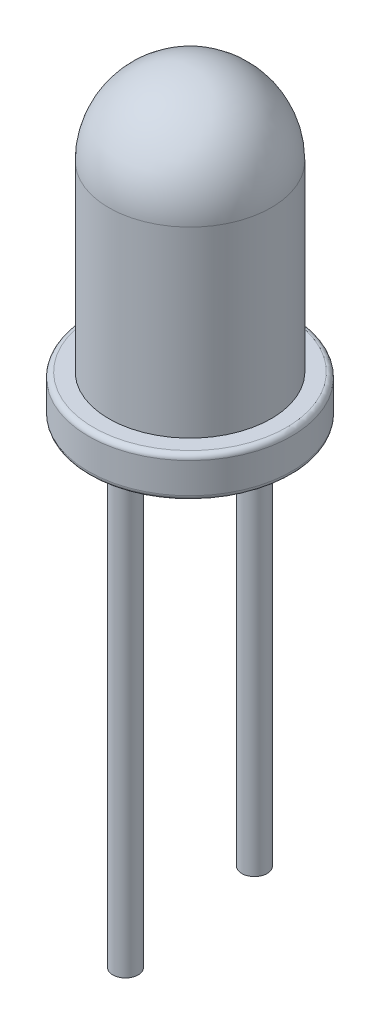
ISO-10303-21;
HEADER;
FILE_DESCRIPTION(('STEP AP214'),'2;1');
FILE_NAME('part.step','',(''),(''),'','','');
FILE_SCHEMA(('AUTOMOTIVE_DESIGN { 1 0 10303 214 1 1 1 1 }'));
ENDSEC;
DATA;
#1=APPLICATION_CONTEXT('core data for automotive mechanical design processes');
#2=APPLICATION_PROTOCOL_DEFINITION('international standard','automotive_design',2000,#1);
#3=PRODUCT_CONTEXT('',#1,'mechanical');
#4=PRODUCT('Part','Part','',(#3));
#5=PRODUCT_RELATED_PRODUCT_CATEGORY('part','',(#4));
#6=PRODUCT_DEFINITION_FORMATION('','',#4);
#7=PRODUCT_DEFINITION_CONTEXT('part definition',#1,'design');
#8=PRODUCT_DEFINITION('design','',#6,#7);
#9=PRODUCT_DEFINITION_SHAPE('','',#8);
#10=(LENGTH_UNIT() NAMED_UNIT(*) SI_UNIT(.MILLI.,.METRE.));
#11=(NAMED_UNIT(*) PLANE_ANGLE_UNIT() SI_UNIT($,.RADIAN.));
#12=(NAMED_UNIT(*) SI_UNIT($,.STERADIAN.) SOLID_ANGLE_UNIT());
#13=UNCERTAINTY_MEASURE_WITH_UNIT(LENGTH_MEASURE(1.E-05),#10,'distance_accuracy_value','');
#14=(GEOMETRIC_REPRESENTATION_CONTEXT(3) GLOBAL_UNCERTAINTY_ASSIGNED_CONTEXT((#13)) GLOBAL_UNIT_ASSIGNED_CONTEXT((#10,
#11,#12)) REPRESENTATION_CONTEXT('',''));
#15=CARTESIAN_POINT('',(0.,0.,0.));
#16=DIRECTION('',(0.,0.,1.));
#17=DIRECTION('',(1.,0.,0.));
#18=AXIS2_PLACEMENT_3D('',#15,#16,#17);
#19=CARTESIAN_POINT('',(0.,4.4,0.));
#20=DIRECTION('',(0.,1.,0.));
#21=DIRECTION('',(-1.,0.,0.));
#22=AXIS2_PLACEMENT_3D('',#19,#20,#21);
#23=SPHERICAL_SURFACE('',#22,1.6);
#24=CARTESIAN_POINT('',(0.,4.4,0.));
#25=DIRECTION('',(0.,1.,0.));
#26=DIRECTION('',(0.,0.,1.));
#27=AXIS2_PLACEMENT_3D('',#24,#25,#26);
#28=CIRCLE('',#27,1.6);
#29=CARTESIAN_POINT('',(0.,4.4,1.6));
#30=VERTEX_POINT('',#29);
#31=EDGE_CURVE('E59',#30,#30,#28,.T.);
#32=ORIENTED_EDGE('',*,*,#31,.T.);
#33=EDGE_LOOP('',(#32));
#34=FACE_BOUND('',#33,.T.);
#35=ADVANCED_FACE('F33',(#34),#23,.T.);
#36=CARTESIAN_POINT('',(0.,8.59832072129685,0.));
#37=DIRECTION('',(0.,1.,0.));
#38=DIRECTION('',(0.,0.,1.));
#39=AXIS2_PLACEMENT_3D('',#36,#37,#38);
#40=CYLINDRICAL_SURFACE('',#39,1.6);
#41=ORIENTED_EDGE('',*,*,#31,.F.);
#42=EDGE_LOOP('',(#41));
#43=FACE_BOUND('',#42,.T.);
#44=CARTESIAN_POINT('',(0.,0.799999999999999,0.));
#45=DIRECTION('',(0.,1.,0.));
#46=DIRECTION('',(0.,0.,1.));
#47=AXIS2_PLACEMENT_3D('',#44,#45,#46);
#48=CIRCLE('',#47,1.6);
#49=CARTESIAN_POINT('',(0.,0.799999999999999,1.6));
#50=VERTEX_POINT('',#49);
#51=EDGE_CURVE('E62',#50,#50,#48,.T.);
#52=ORIENTED_EDGE('',*,*,#51,.T.);
#53=EDGE_LOOP('',(#52));
#54=FACE_BOUND('',#53,.T.);
#55=ADVANCED_FACE('F87',(#43,#54),#40,.T.);
#56=CARTESIAN_POINT('',(0.,0.8,0.));
#57=DIRECTION('',(0.,-1.,0.));
#58=DIRECTION('',(0.,0.,-1.));
#59=AXIS2_PLACEMENT_3D('',#56,#57,#58);
#60=PLANE('',#59);
#61=CARTESIAN_POINT('',(0.,0.8,0.));
#62=DIRECTION('',(0.,-1.,0.));
#63=DIRECTION('',(0.,0.,-1.));
#64=AXIS2_PLACEMENT_3D('',#61,#62,#63);
#65=CIRCLE('',#64,1.9);
#66=CARTESIAN_POINT('',(0.,0.8,-1.9));
#67=VERTEX_POINT('',#66);
#68=EDGE_CURVE('E44',#67,#67,#65,.F.);
#69=ORIENTED_EDGE('',*,*,#68,.T.);
#70=EDGE_LOOP('',(#69));
#71=FACE_BOUND('',#70,.T.);
#72=ORIENTED_EDGE('',*,*,#51,.F.);
#73=EDGE_LOOP('',(#72));
#74=FACE_BOUND('',#73,.T.);
#75=ADVANCED_FACE('F93',(#71,#74),#60,.F.);
#76=CARTESIAN_POINT('',(0.,8.59832072129685,0.));
#77=DIRECTION('',(0.,1.,0.));
#78=DIRECTION('',(0.,0.,1.));
#79=AXIS2_PLACEMENT_3D('',#76,#77,#78);
#80=CYLINDRICAL_SURFACE('',#79,2.);
#81=CARTESIAN_POINT('',(0.,0.0999999999999994,0.));
#82=DIRECTION('',(0.,1.,0.));
#83=DIRECTION('',(0.,0.,1.));
#84=AXIS2_PLACEMENT_3D('',#81,#82,#83);
#85=CIRCLE('',#84,2.);
#86=CARTESIAN_POINT('',(0.,0.0999999999999994,2.));
#87=VERTEX_POINT('',#86);
#88=EDGE_CURVE('E53',#87,#87,#85,.T.);
#89=ORIENTED_EDGE('',*,*,#88,.T.);
#90=EDGE_LOOP('',(#89));
#91=FACE_BOUND('',#90,.T.);
#92=CARTESIAN_POINT('',(0.,0.699999999999999,0.));
#93=DIRECTION('',(0.,-1.,0.));
#94=DIRECTION('',(0.,0.,-1.));
#95=AXIS2_PLACEMENT_3D('',#92,#93,#94);
#96=CIRCLE('',#95,2.);
#97=CARTESIAN_POINT('',(0.,0.699999999999999,-2.));
#98=VERTEX_POINT('',#97);
#99=EDGE_CURVE('E56',#98,#98,#96,.T.);
#100=ORIENTED_EDGE('',*,*,#99,.T.);
#101=EDGE_LOOP('',(#100));
#102=FACE_BOUND('',#101,.T.);
#103=ADVANCED_FACE('F106',(#91,#102),#80,.T.);
#104=CARTESIAN_POINT('',(0.,0.,0.));
#105=DIRECTION('',(0.,1.,0.));
#106=DIRECTION('',(0.,0.,1.));
#107=AXIS2_PLACEMENT_3D('',#104,#105,#106);
#108=PLANE('',#107);
#109=CARTESIAN_POINT('',(1.27,0.,0.));
#110=DIRECTION('',(0.,1.,0.));
#111=DIRECTION('',(0.,0.,1.));
#112=AXIS2_PLACEMENT_3D('',#109,#110,#111);
#113=CIRCLE('',#112,0.25);
#114=CARTESIAN_POINT('',(1.27,0.,0.25));
#115=VERTEX_POINT('',#114);
#116=EDGE_CURVE('E10',#115,#115,#113,.F.);
#117=ORIENTED_EDGE('',*,*,#116,.F.);
#118=EDGE_LOOP('',(#117));
#119=FACE_BOUND('',#118,.T.);
#120=CARTESIAN_POINT('',(-1.27,0.,0.));
#121=DIRECTION('',(0.,1.,0.));
#122=DIRECTION('',(0.,0.,1.));
#123=AXIS2_PLACEMENT_3D('',#120,#121,#122);
#124=CIRCLE('',#123,0.25);
#125=CARTESIAN_POINT('',(-1.27,0.,0.25));
#126=VERTEX_POINT('',#125);
#127=EDGE_CURVE('E40',#126,#126,#124,.F.);
#128=ORIENTED_EDGE('',*,*,#127,.F.);
#129=EDGE_LOOP('',(#128));
#130=FACE_BOUND('',#129,.T.);
#131=CARTESIAN_POINT('',(0.,0.,0.));
#132=DIRECTION('',(0.,1.,0.));
#133=DIRECTION('',(0.,0.,1.));
#134=AXIS2_PLACEMENT_3D('',#131,#132,#133);
#135=CIRCLE('',#134,1.9);
#136=CARTESIAN_POINT('',(0.,0.,1.9));
#137=VERTEX_POINT('',#136);
#138=EDGE_CURVE('E48',#137,#137,#135,.F.);
#139=ORIENTED_EDGE('',*,*,#138,.T.);
#140=EDGE_LOOP('',(#139));
#141=FACE_BOUND('',#140,.T.);
#142=ADVANCED_FACE('F99',(#119,#130,#141),#108,.F.);
#143=CARTESIAN_POINT('',(0.,0.0999999999999994,0.));
#144=DIRECTION('',(0.,1.,0.));
#145=DIRECTION('',(0.,0.,1.));
#146=AXIS2_PLACEMENT_3D('',#143,#144,#145);
#147=TOROIDAL_SURFACE('',#146,1.9,0.1);
#148=ORIENTED_EDGE('',*,*,#138,.F.);
#149=EDGE_LOOP('',(#148));
#150=FACE_BOUND('',#149,.T.);
#151=ORIENTED_EDGE('',*,*,#88,.F.);
#152=EDGE_LOOP('',(#151));
#153=FACE_BOUND('',#152,.T.);
#154=ADVANCED_FACE('F97',(#150,#153),#147,.T.);
#155=CARTESIAN_POINT('',(0.,0.699999999999999,0.));
#156=DIRECTION('',(0.,-1.,0.));
#157=DIRECTION('',(0.,0.,-1.));
#158=AXIS2_PLACEMENT_3D('',#155,#156,#157);
#159=TOROIDAL_SURFACE('',#158,1.9,0.1);
#160=ORIENTED_EDGE('',*,*,#99,.F.);
#161=EDGE_LOOP('',(#160));
#162=FACE_BOUND('',#161,.T.);
#163=ORIENTED_EDGE('',*,*,#68,.F.);
#164=EDGE_LOOP('',(#163));
#165=FACE_BOUND('',#164,.T.);
#166=ADVANCED_FACE('F35',(#162,#165),#159,.T.);
#167=CARTESIAN_POINT('',(-1.27,-10.,0.));
#168=DIRECTION('',(0.,1.,0.));
#169=DIRECTION('',(0.,0.,1.));
#170=AXIS2_PLACEMENT_3D('',#167,#168,#169);
#171=CYLINDRICAL_SURFACE('',#170,0.25);
#172=CARTESIAN_POINT('',(-1.27,-10.,0.));
#173=DIRECTION('',(0.,-1.,0.));
#174=DIRECTION('',(0.,0.,-1.));
#175=AXIS2_PLACEMENT_3D('',#172,#173,#174);
#176=CIRCLE('',#175,0.25);
#177=CARTESIAN_POINT('',(-1.27,-10.,-0.25));
#178=VERTEX_POINT('',#177);
#179=EDGE_CURVE('E65',#178,#178,#176,.T.);
#180=ORIENTED_EDGE('',*,*,#179,.F.);
#181=EDGE_LOOP('',(#180));
#182=FACE_BOUND('',#181,.T.);
#183=ORIENTED_EDGE('',*,*,#127,.T.);
#184=EDGE_LOOP('',(#183));
#185=FACE_BOUND('',#184,.T.);
#186=ADVANCED_FACE('F83',(#182,#185),#171,.T.);
#187=CARTESIAN_POINT('',(-1.27,-10.,0.));
#188=DIRECTION('',(0.,-1.,0.));
#189=DIRECTION('',(0.,0.,-1.));
#190=AXIS2_PLACEMENT_3D('',#187,#188,#189);
#191=PLANE('',#190);
#192=ORIENTED_EDGE('',*,*,#179,.T.);
#193=EDGE_LOOP('',(#192));
#194=FACE_BOUND('',#193,.T.);
#195=ADVANCED_FACE('F76',(#194),#191,.T.);
#196=CARTESIAN_POINT('',(1.27,-7.,0.));
#197=DIRECTION('',(0.,1.,0.));
#198=DIRECTION('',(0.,0.,1.));
#199=AXIS2_PLACEMENT_3D('',#196,#197,#198);
#200=CYLINDRICAL_SURFACE('',#199,0.25);
#201=CARTESIAN_POINT('',(1.27,-7.,0.));
#202=DIRECTION('',(0.,-1.,0.));
#203=DIRECTION('',(0.,0.,-1.));
#204=AXIS2_PLACEMENT_3D('',#201,#202,#203);
#205=CIRCLE('',#204,0.25);
#206=CARTESIAN_POINT('',(1.27,-7.,-0.25));
#207=VERTEX_POINT('',#206);
#208=EDGE_CURVE('E68',#207,#207,#205,.T.);
#209=ORIENTED_EDGE('',*,*,#208,.F.);
#210=EDGE_LOOP('',(#209));
#211=FACE_BOUND('',#210,.T.);
#212=ORIENTED_EDGE('',*,*,#116,.T.);
#213=EDGE_LOOP('',(#212));
#214=FACE_BOUND('',#213,.T.);
#215=ADVANCED_FACE('F74',(#211,#214),#200,.T.);
#216=CARTESIAN_POINT('',(1.27,-7.,0.));
#217=DIRECTION('',(0.,-1.,0.));
#218=DIRECTION('',(0.,0.,-1.));
#219=AXIS2_PLACEMENT_3D('',#216,#217,#218);
#220=PLANE('',#219);
#221=ORIENTED_EDGE('',*,*,#208,.T.);
#222=EDGE_LOOP('',(#221));
#223=FACE_BOUND('',#222,.T.);
#224=ADVANCED_FACE('F72',(#223),#220,.T.);
#225=CLOSED_SHELL('',(#35,#55,#75,#103,#142,#154,#166,#186,#195,#215,#224));
#226=MANIFOLD_SOLID_BREP('B2',#225);
#227=ADVANCED_BREP_SHAPE_REPRESENTATION('',(#18,#226),#14);
#228=SHAPE_DEFINITION_REPRESENTATION(#9,#227);
ENDSEC;
END-ISO-10303-21;
